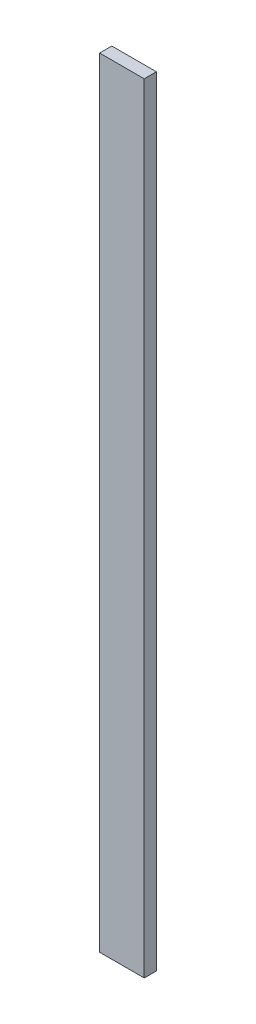
ISO-10303-21;
HEADER;
FILE_DESCRIPTION(('STEP AP214'),'2;1');
FILE_NAME('part.step','',(''),(''),'','','');
FILE_SCHEMA(('AUTOMOTIVE_DESIGN { 1 0 10303 214 1 1 1 1 }'));
ENDSEC;
DATA;
#1=APPLICATION_CONTEXT('core data for automotive mechanical design processes');
#2=APPLICATION_PROTOCOL_DEFINITION('international standard','automotive_design',2000,#1);
#3=PRODUCT_CONTEXT('',#1,'mechanical');
#4=PRODUCT('Part','Part','',(#3));
#5=PRODUCT_RELATED_PRODUCT_CATEGORY('part','',(#4));
#6=PRODUCT_DEFINITION_FORMATION('','',#4);
#7=PRODUCT_DEFINITION_CONTEXT('part definition',#1,'design');
#8=PRODUCT_DEFINITION('design','',#6,#7);
#9=PRODUCT_DEFINITION_SHAPE('','',#8);
#10=(LENGTH_UNIT() NAMED_UNIT(*) SI_UNIT(.MILLI.,.METRE.));
#11=(NAMED_UNIT(*) PLANE_ANGLE_UNIT() SI_UNIT($,.RADIAN.));
#12=(NAMED_UNIT(*) SI_UNIT($,.STERADIAN.) SOLID_ANGLE_UNIT());
#13=UNCERTAINTY_MEASURE_WITH_UNIT(LENGTH_MEASURE(1.E-05),#10,'distance_accuracy_value','');
#14=(GEOMETRIC_REPRESENTATION_CONTEXT(3) GLOBAL_UNCERTAINTY_ASSIGNED_CONTEXT((#13)) GLOBAL_UNIT_ASSIGNED_CONTEXT((#10,
#11,#12)) REPRESENTATION_CONTEXT('',''));
#15=CARTESIAN_POINT('',(0.,0.,0.));
#16=DIRECTION('',(0.,0.,1.));
#17=DIRECTION('',(1.,0.,0.));
#18=AXIS2_PLACEMENT_3D('',#15,#16,#17);
#19=CARTESIAN_POINT('',(-69.85,2438.4,19.05));
#20=DIRECTION('',(-1.,0.,0.));
#21=DIRECTION('',(0.,0.,1.));
#22=AXIS2_PLACEMENT_3D('',#19,#20,#21);
#23=PLANE('',#22);
#24=DIRECTION('',(0.,0.,-1.));
#25=VECTOR('',#24,1.);
#26=CARTESIAN_POINT('',(-69.85,0.,19.05));
#27=LINE('',#26,#25);
#28=CARTESIAN_POINT('',(-69.85,0.,19.05));
#29=VERTEX_POINT('',#28);
#30=CARTESIAN_POINT('',(-69.85,0.,-19.05));
#31=VERTEX_POINT('',#30);
#32=EDGE_CURVE('E104',#29,#31,#27,.T.);
#33=ORIENTED_EDGE('',*,*,#32,.F.);
#34=DIRECTION('',(0.,-1.,0.));
#35=VECTOR('',#34,1.);
#36=CARTESIAN_POINT('',(-69.85,2438.4,19.05));
#37=LINE('',#36,#35);
#38=CARTESIAN_POINT('',(-69.85,2438.4,19.05));
#39=VERTEX_POINT('',#38);
#40=EDGE_CURVE('E11',#39,#29,#37,.T.);
#41=ORIENTED_EDGE('',*,*,#40,.F.);
#42=DIRECTION('',(0.,0.,-1.));
#43=VECTOR('',#42,1.);
#44=CARTESIAN_POINT('',(-69.85,2438.4,19.05));
#45=LINE('',#44,#43);
#46=CARTESIAN_POINT('',(-69.85,2438.4,-19.05));
#47=VERTEX_POINT('',#46);
#48=EDGE_CURVE('E99',#39,#47,#45,.T.);
#49=ORIENTED_EDGE('',*,*,#48,.T.);
#50=DIRECTION('',(0.,-1.,0.));
#51=VECTOR('',#50,1.);
#52=CARTESIAN_POINT('',(-69.85,2438.4,-19.05));
#53=LINE('',#52,#51);
#54=EDGE_CURVE('E42',#47,#31,#53,.T.);
#55=ORIENTED_EDGE('',*,*,#54,.T.);
#56=EDGE_LOOP('',(#33,#41,#49,#55));
#57=FACE_BOUND('',#56,.T.);
#58=ADVANCED_FACE('F39',(#57),#23,.T.);
#59=CARTESIAN_POINT('',(-69.85,2438.4,19.05));
#60=DIRECTION('',(0.,0.,-1.));
#61=DIRECTION('',(-1.,0.,0.));
#62=AXIS2_PLACEMENT_3D('',#59,#60,#61);
#63=PLANE('',#62);
#64=DIRECTION('',(1.,0.,0.));
#65=VECTOR('',#64,1.);
#66=CARTESIAN_POINT('',(-69.85,0.,19.05));
#67=LINE('',#66,#65);
#68=CARTESIAN_POINT('',(69.85,0.,19.05));
#69=VERTEX_POINT('',#68);
#70=EDGE_CURVE('E72',#29,#69,#67,.T.);
#71=ORIENTED_EDGE('',*,*,#70,.T.);
#72=DIRECTION('',(0.,-1.,0.));
#73=VECTOR('',#72,1.);
#74=CARTESIAN_POINT('',(69.85,2438.4,19.05));
#75=LINE('',#74,#73);
#76=CARTESIAN_POINT('',(69.85,2438.4,19.05));
#77=VERTEX_POINT('',#76);
#78=EDGE_CURVE('E48',#77,#69,#75,.T.);
#79=ORIENTED_EDGE('',*,*,#78,.F.);
#80=DIRECTION('',(1.,0.,0.));
#81=VECTOR('',#80,1.);
#82=CARTESIAN_POINT('',(-69.85,2438.4,19.05));
#83=LINE('',#82,#81);
#84=EDGE_CURVE('E89',#39,#77,#83,.T.);
#85=ORIENTED_EDGE('',*,*,#84,.F.);
#86=ORIENTED_EDGE('',*,*,#40,.T.);
#87=EDGE_LOOP('',(#71,#79,#85,#86));
#88=FACE_BOUND('',#87,.T.);
#89=ADVANCED_FACE('F114',(#88),#63,.F.);
#90=CARTESIAN_POINT('',(69.85,2438.4,19.05));
#91=DIRECTION('',(-1.,0.,0.));
#92=DIRECTION('',(0.,0.,1.));
#93=AXIS2_PLACEMENT_3D('',#90,#91,#92);
#94=PLANE('',#93);
#95=DIRECTION('',(0.,0.,-1.));
#96=VECTOR('',#95,1.);
#97=CARTESIAN_POINT('',(69.85,0.,19.05));
#98=LINE('',#97,#96);
#99=CARTESIAN_POINT('',(69.85,0.,-19.05));
#100=VERTEX_POINT('',#99);
#101=EDGE_CURVE('E96',#69,#100,#98,.T.);
#102=ORIENTED_EDGE('',*,*,#101,.T.);
#103=DIRECTION('',(0.,-1.,0.));
#104=VECTOR('',#103,1.);
#105=CARTESIAN_POINT('',(69.85,2438.4,-19.05));
#106=LINE('',#105,#104);
#107=CARTESIAN_POINT('',(69.85,2438.4,-19.05));
#108=VERTEX_POINT('',#107);
#109=EDGE_CURVE('E93',#108,#100,#106,.T.);
#110=ORIENTED_EDGE('',*,*,#109,.F.);
#111=DIRECTION('',(0.,0.,-1.));
#112=VECTOR('',#111,1.);
#113=CARTESIAN_POINT('',(69.85,2438.4,19.05));
#114=LINE('',#113,#112);
#115=EDGE_CURVE('E84',#77,#108,#114,.T.);
#116=ORIENTED_EDGE('',*,*,#115,.F.);
#117=ORIENTED_EDGE('',*,*,#78,.T.);
#118=EDGE_LOOP('',(#102,#110,#116,#117));
#119=FACE_BOUND('',#118,.T.);
#120=ADVANCED_FACE('F94',(#119),#94,.F.);
#121=CARTESIAN_POINT('',(-69.85,2438.4,-19.05));
#122=DIRECTION('',(0.,0.,-1.));
#123=DIRECTION('',(-1.,0.,0.));
#124=AXIS2_PLACEMENT_3D('',#121,#122,#123);
#125=PLANE('',#124);
#126=DIRECTION('',(1.,0.,0.));
#127=VECTOR('',#126,1.);
#128=CARTESIAN_POINT('',(-69.85,0.,-19.05));
#129=LINE('',#128,#127);
#130=EDGE_CURVE('E107',#31,#100,#129,.T.);
#131=ORIENTED_EDGE('',*,*,#130,.F.);
#132=ORIENTED_EDGE('',*,*,#54,.F.);
#133=DIRECTION('',(1.,0.,0.));
#134=VECTOR('',#133,1.);
#135=CARTESIAN_POINT('',(-69.85,2438.4,-19.05));
#136=LINE('',#135,#134);
#137=EDGE_CURVE('E88',#47,#108,#136,.T.);
#138=ORIENTED_EDGE('',*,*,#137,.T.);
#139=ORIENTED_EDGE('',*,*,#109,.T.);
#140=EDGE_LOOP('',(#131,#132,#138,#139));
#141=FACE_BOUND('',#140,.T.);
#142=ADVANCED_FACE('F98',(#141),#125,.T.);
#143=CARTESIAN_POINT('',(0.,2438.4,0.));
#144=DIRECTION('',(0.,-1.,0.));
#145=DIRECTION('',(0.,0.,-1.));
#146=AXIS2_PLACEMENT_3D('',#143,#144,#145);
#147=PLANE('',#146);
#148=ORIENTED_EDGE('',*,*,#48,.F.);
#149=ORIENTED_EDGE('',*,*,#84,.T.);
#150=ORIENTED_EDGE('',*,*,#115,.T.);
#151=ORIENTED_EDGE('',*,*,#137,.F.);
#152=EDGE_LOOP('',(#148,#149,#150,#151));
#153=FACE_BOUND('',#152,.T.);
#154=ADVANCED_FACE('F87',(#153),#147,.F.);
#155=CARTESIAN_POINT('',(0.,0.,0.));
#156=DIRECTION('',(0.,-1.,0.));
#157=DIRECTION('',(0.,0.,-1.));
#158=AXIS2_PLACEMENT_3D('',#155,#156,#157);
#159=PLANE('',#158);
#160=ORIENTED_EDGE('',*,*,#32,.T.);
#161=ORIENTED_EDGE('',*,*,#130,.T.);
#162=ORIENTED_EDGE('',*,*,#101,.F.);
#163=ORIENTED_EDGE('',*,*,#70,.F.);
#164=EDGE_LOOP('',(#160,#161,#162,#163));
#165=FACE_BOUND('',#164,.T.);
#166=ADVANCED_FACE('F112',(#165),#159,.T.);
#167=CLOSED_SHELL('',(#58,#89,#120,#142,#154,#166));
#168=MANIFOLD_SOLID_BREP('B2',#167);
#169=ADVANCED_BREP_SHAPE_REPRESENTATION('',(#18,#168),#14);
#170=SHAPE_DEFINITION_REPRESENTATION(#9,#169);
ENDSEC;
END-ISO-10303-21;
